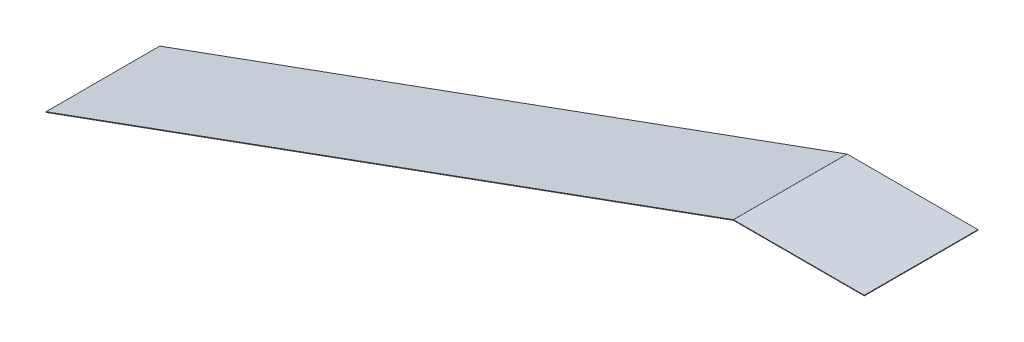
ISO-10303-21;
HEADER;
FILE_DESCRIPTION(('STEP AP214'),'2;1');
FILE_NAME('part.step','',(''),(''),'','','');
FILE_SCHEMA(('AUTOMOTIVE_DESIGN { 1 0 10303 214 1 1 1 1 }'));
ENDSEC;
DATA;
#1=APPLICATION_CONTEXT('core data for automotive mechanical design processes');
#2=APPLICATION_PROTOCOL_DEFINITION('international standard','automotive_design',2000,#1);
#3=PRODUCT_CONTEXT('',#1,'mechanical');
#4=PRODUCT('Part','Part','',(#3));
#5=PRODUCT_RELATED_PRODUCT_CATEGORY('part','',(#4));
#6=PRODUCT_DEFINITION_FORMATION('','',#4);
#7=PRODUCT_DEFINITION_CONTEXT('part definition',#1,'design');
#8=PRODUCT_DEFINITION('design','',#6,#7);
#9=PRODUCT_DEFINITION_SHAPE('','',#8);
#10=(LENGTH_UNIT() NAMED_UNIT(*) SI_UNIT(.MILLI.,.METRE.));
#11=(NAMED_UNIT(*) PLANE_ANGLE_UNIT() SI_UNIT($,.RADIAN.));
#12=(NAMED_UNIT(*) SI_UNIT($,.STERADIAN.) SOLID_ANGLE_UNIT());
#13=UNCERTAINTY_MEASURE_WITH_UNIT(LENGTH_MEASURE(1.E-05),#10,'distance_accuracy_value','');
#14=(GEOMETRIC_REPRESENTATION_CONTEXT(3) GLOBAL_UNCERTAINTY_ASSIGNED_CONTEXT((#13)) GLOBAL_UNIT_ASSIGNED_CONTEXT((#10,
#11,#12)) REPRESENTATION_CONTEXT('',''));
#15=CARTESIAN_POINT('',(0.,0.,0.));
#16=DIRECTION('',(0.,0.,1.));
#17=DIRECTION('',(1.,0.,0.));
#18=AXIS2_PLACEMENT_3D('',#15,#16,#17);
#19=CARTESIAN_POINT('',(1208.72437139741,439.939692620786,200.));
#20=DIRECTION('',(0.,0.,1.));
#21=DIRECTION('',(1.,0.,0.));
#22=AXIS2_PLACEMENT_3D('',#19,#20,#21);
#23=PLANE('',#22);
#24=DIRECTION('',(-0.342020143325728,0.939692620785887,0.));
#25=VECTOR('',#24,1.);
#26=CARTESIAN_POINT('',(1208.72437139741,439.939692620786,200.));
#27=LINE('',#26,#25);
#28=CARTESIAN_POINT('',(1208.72437139741,439.939692620786,200.));
#29=VERTEX_POINT('',#28);
#30=CARTESIAN_POINT('',(1208.38235125409,440.879385241572,200.));
#31=VERTEX_POINT('',#30);
#32=EDGE_CURVE('E11',#29,#31,#27,.T.);
#33=ORIENTED_EDGE('',*,*,#32,.F.);
#34=CARTESIAN_POINT('',(1209.06639154074,439.,200.));
#35=DIRECTION('',(0.,0.,-1.));
#36=DIRECTION('',(-1.,0.,0.));
#37=AXIS2_PLACEMENT_3D('',#34,#35,#36);
#38=CIRCLE('',#37,1.);
#39=CARTESIAN_POINT('',(1209.06639154074,440.,200.));
#40=VERTEX_POINT('',#39);
#41=EDGE_CURVE('E136',#40,#29,#38,.F.);
#42=ORIENTED_EDGE('',*,*,#41,.F.);
#43=DIRECTION('',(0.,-1.,0.));
#44=VECTOR('',#43,1.);
#45=CARTESIAN_POINT('',(1209.06639154074,441.,200.));
#46=LINE('',#45,#44);
#47=CARTESIAN_POINT('',(1209.06639154074,441.,200.));
#48=VERTEX_POINT('',#47);
#49=EDGE_CURVE('E47',#48,#40,#46,.T.);
#50=ORIENTED_EDGE('',*,*,#49,.F.);
#51=CARTESIAN_POINT('',(1209.06639154074,439.,200.));
#52=DIRECTION('',(0.,0.,1.));
#53=DIRECTION('',(1.,0.,0.));
#54=AXIS2_PLACEMENT_3D('',#51,#52,#53);
#55=CIRCLE('',#54,2.);
#56=EDGE_CURVE('E129',#48,#31,#55,.T.);
#57=ORIENTED_EDGE('',*,*,#56,.T.);
#58=EDGE_LOOP('',(#33,#42,#50,#57));
#59=FACE_BOUND('',#58,.T.);
#60=ADVANCED_FACE('F39',(#59),#23,.T.);
#61=CARTESIAN_POINT('',(1209.06639154074,441.,200.));
#62=DIRECTION('',(0.,0.,1.));
#63=DIRECTION('',(1.,0.,0.));
#64=AXIS2_PLACEMENT_3D('',#61,#62,#63);
#65=PLANE('',#64);
#66=DIRECTION('',(-0.939692620785908,-0.342020143325669,0.));
#67=VECTOR('',#66,1.);
#68=CARTESIAN_POINT('',(1208.89006456003,440.,200.));
#69=LINE('',#68,#67);
#70=CARTESIAN_POINT('',(0.,0.,200.));
#71=VERTEX_POINT('',#70);
#72=EDGE_CURVE('E185',#29,#71,#69,.T.);
#73=ORIENTED_EDGE('',*,*,#72,.F.);
#74=ORIENTED_EDGE('',*,*,#32,.T.);
#75=DIRECTION('',(-0.939692620785908,-0.34202014332567,0.));
#76=VECTOR('',#75,1.);
#77=CARTESIAN_POINT('',(1208.54804441671,440.939692620786,200.));
#78=LINE('',#77,#76);
#79=CARTESIAN_POINT('',(-0.342020143325961,0.939692620785859,200.));
#80=VERTEX_POINT('',#79);
#81=EDGE_CURVE('E95',#31,#80,#78,.T.);
#82=ORIENTED_EDGE('',*,*,#81,.T.);
#83=DIRECTION('',(-0.342020143325942,0.939692620785809,0.));
#84=VECTOR('',#83,1.);
#85=CARTESIAN_POINT('',(0.,0.,200.));
#86=LINE('',#85,#84);
#87=EDGE_CURVE('E342',#71,#80,#86,.T.);
#88=ORIENTED_EDGE('',*,*,#87,.F.);
#89=EDGE_LOOP('',(#73,#74,#82,#88));
#90=FACE_BOUND('',#89,.T.);
#91=ADVANCED_FACE('F193',(#90),#65,.T.);
#92=CARTESIAN_POINT('',(1209.06639154074,440.,0.));
#93=DIRECTION('',(0.,0.,-1.));
#94=DIRECTION('',(-1.,0.,0.));
#95=AXIS2_PLACEMENT_3D('',#92,#93,#94);
#96=PLANE('',#95);
#97=DIRECTION('',(0.,1.,0.));
#98=VECTOR('',#97,1.);
#99=CARTESIAN_POINT('',(1209.06639154074,440.,0.));
#100=LINE('',#99,#98);
#101=CARTESIAN_POINT('',(1209.06639154074,440.,0.));
#102=VERTEX_POINT('',#101);
#103=CARTESIAN_POINT('',(1209.06639154074,441.,0.));
#104=VERTEX_POINT('',#103);
#105=EDGE_CURVE('E82',#102,#104,#100,.T.);
#106=ORIENTED_EDGE('',*,*,#105,.F.);
#107=CARTESIAN_POINT('',(1209.06639154074,439.,0.));
#108=DIRECTION('',(0.,0.,-1.));
#109=DIRECTION('',(-1.,0.,0.));
#110=AXIS2_PLACEMENT_3D('',#107,#108,#109);
#111=CIRCLE('',#110,1.);
#112=CARTESIAN_POINT('',(1208.72437139741,439.939692620786,0.));
#113=VERTEX_POINT('',#112);
#114=EDGE_CURVE('E151',#102,#113,#111,.F.);
#115=ORIENTED_EDGE('',*,*,#114,.T.);
#116=DIRECTION('',(0.342020143325728,-0.939692620785887,0.));
#117=VECTOR('',#116,1.);
#118=CARTESIAN_POINT('',(1208.38235125409,440.879385241572,0.));
#119=LINE('',#118,#117);
#120=CARTESIAN_POINT('',(1208.38235125409,440.879385241572,0.));
#121=VERTEX_POINT('',#120);
#122=EDGE_CURVE('E89',#121,#113,#119,.T.);
#123=ORIENTED_EDGE('',*,*,#122,.F.);
#124=CARTESIAN_POINT('',(1209.06639154074,439.,0.));
#125=DIRECTION('',(0.,0.,1.));
#126=DIRECTION('',(1.,0.,0.));
#127=AXIS2_PLACEMENT_3D('',#124,#125,#126);
#128=CIRCLE('',#127,2.);
#129=EDGE_CURVE('E158',#104,#121,#128,.T.);
#130=ORIENTED_EDGE('',*,*,#129,.F.);
#131=EDGE_LOOP('',(#106,#115,#123,#130));
#132=FACE_BOUND('',#131,.T.);
#133=ADVANCED_FACE('F191',(#132),#96,.T.);
#134=CARTESIAN_POINT('',(1208.38235125409,440.879385241572,0.));
#135=DIRECTION('',(0.,0.,-1.));
#136=DIRECTION('',(-1.,0.,0.));
#137=AXIS2_PLACEMENT_3D('',#134,#135,#136);
#138=PLANE('',#137);
#139=DIRECTION('',(-1.,0.,0.));
#140=VECTOR('',#139,1.);
#141=CARTESIAN_POINT('',(1439.004105869,440.,0.));
#142=LINE('',#141,#140);
#143=CARTESIAN_POINT('',(1439.004105869,440.,0.));
#144=VERTEX_POINT('',#143);
#145=EDGE_CURVE('E153',#144,#102,#142,.T.);
#146=ORIENTED_EDGE('',*,*,#145,.T.);
#147=ORIENTED_EDGE('',*,*,#105,.T.);
#148=DIRECTION('',(-1.,0.,0.));
#149=VECTOR('',#148,1.);
#150=CARTESIAN_POINT('',(1439.004105869,441.,0.));
#151=LINE('',#150,#149);
#152=CARTESIAN_POINT('',(1439.004105869,441.,0.));
#153=VERTEX_POINT('',#152);
#154=EDGE_CURVE('E156',#153,#104,#151,.T.);
#155=ORIENTED_EDGE('',*,*,#154,.F.);
#156=DIRECTION('',(0.,-1.,0.));
#157=VECTOR('',#156,1.);
#158=CARTESIAN_POINT('',(1439.004105869,441.,0.));
#159=LINE('',#158,#157);
#160=EDGE_CURVE('E117',#153,#144,#159,.T.);
#161=ORIENTED_EDGE('',*,*,#160,.T.);
#162=EDGE_LOOP('',(#146,#147,#155,#161));
#163=FACE_BOUND('',#162,.T.);
#164=ADVANCED_FACE('F187',(#163),#138,.T.);
#165=CARTESIAN_POINT('',(1208.54804441671,440.939692620786,200.));
#166=DIRECTION('',(0.342020143325669,-0.939692620785908,0.));
#167=DIRECTION('',(0.939692620785908,0.342020143325669,0.));
#168=AXIS2_PLACEMENT_3D('',#165,#166,#167);
#169=PLANE('',#168);
#170=DIRECTION('',(-0.939692620785908,-0.34202014332567,0.));
#171=VECTOR('',#170,1.);
#172=CARTESIAN_POINT('',(1208.54804441671,440.939692620786,0.));
#173=LINE('',#172,#171);
#174=CARTESIAN_POINT('',(-0.342020143325961,0.939692620785859,0.));
#175=VERTEX_POINT('',#174);
#176=EDGE_CURVE('E142',#121,#175,#173,.T.);
#177=ORIENTED_EDGE('',*,*,#176,.T.);
#178=DIRECTION('',(0.,0.,-1.));
#179=VECTOR('',#178,1.);
#180=CARTESIAN_POINT('',(-0.342020143325961,0.939692620785859,200.));
#181=LINE('',#180,#179);
#182=EDGE_CURVE('E172',#80,#175,#181,.T.);
#183=ORIENTED_EDGE('',*,*,#182,.F.);
#184=ORIENTED_EDGE('',*,*,#81,.F.);
#185=DIRECTION('',(0.,0.,-1.));
#186=VECTOR('',#185,1.);
#187=CARTESIAN_POINT('',(1208.38235125409,440.879385241572,200.));
#188=LINE('',#187,#186);
#189=EDGE_CURVE('E141',#31,#121,#188,.T.);
#190=ORIENTED_EDGE('',*,*,#189,.T.);
#191=EDGE_LOOP('',(#177,#183,#184,#190));
#192=FACE_BOUND('',#191,.T.);
#193=ADVANCED_FACE('F199',(#192),#169,.F.);
#194=CARTESIAN_POINT('',(0.,0.,200.));
#195=DIRECTION('',(-0.939692620785809,-0.342020143325942,0.));
#196=DIRECTION('',(0.342020143325942,-0.939692620785809,0.));
#197=AXIS2_PLACEMENT_3D('',#194,#195,#196);
#198=PLANE('',#197);
#199=DIRECTION('',(-0.342020143325942,0.939692620785809,0.));
#200=VECTOR('',#199,1.);
#201=CARTESIAN_POINT('',(0.,0.,0.));
#202=LINE('',#201,#200);
#203=CARTESIAN_POINT('',(0.,0.,0.));
#204=VERTEX_POINT('',#203);
#205=EDGE_CURVE('E145',#204,#175,#202,.T.);
#206=ORIENTED_EDGE('',*,*,#205,.F.);
#207=DIRECTION('',(0.,0.,-1.));
#208=VECTOR('',#207,1.);
#209=CARTESIAN_POINT('',(0.,0.,200.));
#210=LINE('',#209,#208);
#211=EDGE_CURVE('E170',#71,#204,#210,.T.);
#212=ORIENTED_EDGE('',*,*,#211,.F.);
#213=ORIENTED_EDGE('',*,*,#87,.T.);
#214=ORIENTED_EDGE('',*,*,#182,.T.);
#215=EDGE_LOOP('',(#206,#212,#213,#214));
#216=FACE_BOUND('',#215,.T.);
#217=ADVANCED_FACE('F230',(#216),#198,.T.);
#218=CARTESIAN_POINT('',(1208.89006456003,440.,200.));
#219=DIRECTION('',(0.342020143325669,-0.939692620785908,0.));
#220=DIRECTION('',(0.939692620785908,0.34202014332567,0.));
#221=AXIS2_PLACEMENT_3D('',#218,#219,#220);
#222=PLANE('',#221);
#223=DIRECTION('',(-0.939692620785908,-0.342020143325669,0.));
#224=VECTOR('',#223,1.);
#225=CARTESIAN_POINT('',(1208.89006456003,440.,0.));
#226=LINE('',#225,#224);
#227=EDGE_CURVE('E148',#113,#204,#226,.T.);
#228=ORIENTED_EDGE('',*,*,#227,.F.);
#229=DIRECTION('',(0.,0.,-1.));
#230=VECTOR('',#229,1.);
#231=CARTESIAN_POINT('',(1208.72437139741,439.939692620786,200.));
#232=LINE('',#231,#230);
#233=EDGE_CURVE('E167',#29,#113,#232,.T.);
#234=ORIENTED_EDGE('',*,*,#233,.F.);
#235=ORIENTED_EDGE('',*,*,#72,.T.);
#236=ORIENTED_EDGE('',*,*,#211,.T.);
#237=EDGE_LOOP('',(#228,#234,#235,#236));
#238=FACE_BOUND('',#237,.T.);
#239=ADVANCED_FACE('F241',(#238),#222,.T.);
#240=CARTESIAN_POINT('',(1209.06639154074,439.,200.));
#241=DIRECTION('',(0.,0.,-1.));
#242=DIRECTION('',(-1.,0.,0.));
#243=AXIS2_PLACEMENT_3D('',#240,#241,#242);
#244=CYLINDRICAL_SURFACE('',#243,1.);
#245=ORIENTED_EDGE('',*,*,#114,.F.);
#246=DIRECTION('',(0.,0.,-1.));
#247=VECTOR('',#246,1.);
#248=CARTESIAN_POINT('',(1209.06639154074,440.,200.));
#249=LINE('',#248,#247);
#250=EDGE_CURVE('E164',#40,#102,#249,.T.);
#251=ORIENTED_EDGE('',*,*,#250,.F.);
#252=ORIENTED_EDGE('',*,*,#41,.T.);
#253=ORIENTED_EDGE('',*,*,#233,.T.);
#254=EDGE_LOOP('',(#245,#251,#252,#253));
#255=FACE_BOUND('',#254,.T.);
#256=ADVANCED_FACE('F181',(#255),#244,.F.);
#257=CARTESIAN_POINT('',(1439.004105869,440.,200.));
#258=DIRECTION('',(0.,-1.,0.));
#259=DIRECTION('',(1.,0.,0.));
#260=AXIS2_PLACEMENT_3D('',#257,#258,#259);
#261=PLANE('',#260);
#262=ORIENTED_EDGE('',*,*,#145,.F.);
#263=DIRECTION('',(0.,0.,-1.));
#264=VECTOR('',#263,1.);
#265=CARTESIAN_POINT('',(1439.004105869,440.,200.));
#266=LINE('',#265,#264);
#267=CARTESIAN_POINT('',(1439.004105869,440.,200.));
#268=VERTEX_POINT('',#267);
#269=EDGE_CURVE('E119',#268,#144,#266,.T.);
#270=ORIENTED_EDGE('',*,*,#269,.F.);
#271=DIRECTION('',(-1.,0.,0.));
#272=VECTOR('',#271,1.);
#273=CARTESIAN_POINT('',(1439.004105869,440.,200.));
#274=LINE('',#273,#272);
#275=EDGE_CURVE('E134',#268,#40,#274,.T.);
#276=ORIENTED_EDGE('',*,*,#275,.T.);
#277=ORIENTED_EDGE('',*,*,#250,.T.);
#278=EDGE_LOOP('',(#262,#270,#276,#277));
#279=FACE_BOUND('',#278,.T.);
#280=ADVANCED_FACE('F186',(#279),#261,.T.);
#281=CARTESIAN_POINT('',(1439.004105869,441.,200.));
#282=DIRECTION('',(1.,0.,0.));
#283=DIRECTION('',(0.,0.,-1.));
#284=AXIS2_PLACEMENT_3D('',#281,#282,#283);
#285=PLANE('',#284);
#286=ORIENTED_EDGE('',*,*,#160,.F.);
#287=DIRECTION('',(0.,0.,-1.));
#288=VECTOR('',#287,1.);
#289=CARTESIAN_POINT('',(1439.004105869,441.,200.));
#290=LINE('',#289,#288);
#291=CARTESIAN_POINT('',(1439.004105869,441.,200.));
#292=VERTEX_POINT('',#291);
#293=EDGE_CURVE('E111',#292,#153,#290,.T.);
#294=ORIENTED_EDGE('',*,*,#293,.F.);
#295=DIRECTION('',(0.,-1.,0.));
#296=VECTOR('',#295,1.);
#297=CARTESIAN_POINT('',(1439.004105869,441.,200.));
#298=LINE('',#297,#296);
#299=EDGE_CURVE('E115',#292,#268,#298,.T.);
#300=ORIENTED_EDGE('',*,*,#299,.T.);
#301=ORIENTED_EDGE('',*,*,#269,.T.);
#302=EDGE_LOOP('',(#286,#294,#300,#301));
#303=FACE_BOUND('',#302,.T.);
#304=ADVANCED_FACE('F113',(#303),#285,.T.);
#305=CARTESIAN_POINT('',(1439.004105869,441.,200.));
#306=DIRECTION('',(0.,-1.,0.));
#307=DIRECTION('',(1.,0.,0.));
#308=AXIS2_PLACEMENT_3D('',#305,#306,#307);
#309=PLANE('',#308);
#310=ORIENTED_EDGE('',*,*,#154,.T.);
#311=DIRECTION('',(0.,0.,-1.));
#312=VECTOR('',#311,1.);
#313=CARTESIAN_POINT('',(1209.06639154074,441.,200.));
#314=LINE('',#313,#312);
#315=EDGE_CURVE('E120',#48,#104,#314,.T.);
#316=ORIENTED_EDGE('',*,*,#315,.F.);
#317=DIRECTION('',(-1.,0.,0.));
#318=VECTOR('',#317,1.);
#319=CARTESIAN_POINT('',(1439.004105869,441.,200.));
#320=LINE('',#319,#318);
#321=EDGE_CURVE('E124',#292,#48,#320,.T.);
#322=ORIENTED_EDGE('',*,*,#321,.F.);
#323=ORIENTED_EDGE('',*,*,#293,.T.);
#324=EDGE_LOOP('',(#310,#316,#322,#323));
#325=FACE_BOUND('',#324,.T.);
#326=ADVANCED_FACE('F125',(#325),#309,.F.);
#327=CARTESIAN_POINT('',(1209.06639154074,439.,200.));
#328=DIRECTION('',(0.,0.,-1.));
#329=DIRECTION('',(-1.,0.,0.));
#330=AXIS2_PLACEMENT_3D('',#327,#328,#329);
#331=CYLINDRICAL_SURFACE('',#330,2.);
#332=ORIENTED_EDGE('',*,*,#129,.T.);
#333=ORIENTED_EDGE('',*,*,#189,.F.);
#334=ORIENTED_EDGE('',*,*,#56,.F.);
#335=ORIENTED_EDGE('',*,*,#315,.T.);
#336=EDGE_LOOP('',(#332,#333,#334,#335));
#337=FACE_BOUND('',#336,.T.);
#338=ADVANCED_FACE('F189',(#337),#331,.T.);
#339=CARTESIAN_POINT('',(1209.06639154074,439.,200.));
#340=DIRECTION('',(0.,0.,-1.));
#341=DIRECTION('',(-1.,0.,0.));
#342=AXIS2_PLACEMENT_3D('',#339,#340,#341);
#343=PLANE('',#342);
#344=ORIENTED_EDGE('',*,*,#321,.T.);
#345=ORIENTED_EDGE('',*,*,#49,.T.);
#346=ORIENTED_EDGE('',*,*,#275,.F.);
#347=ORIENTED_EDGE('',*,*,#299,.F.);
#348=EDGE_LOOP('',(#344,#345,#346,#347));
#349=FACE_BOUND('',#348,.T.);
#350=ADVANCED_FACE('F132',(#349),#343,.F.);
#351=CARTESIAN_POINT('',(1209.06639154074,439.,0.));
#352=DIRECTION('',(0.,0.,-1.));
#353=DIRECTION('',(-1.,0.,0.));
#354=AXIS2_PLACEMENT_3D('',#351,#352,#353);
#355=PLANE('',#354);
#356=ORIENTED_EDGE('',*,*,#176,.F.);
#357=ORIENTED_EDGE('',*,*,#122,.T.);
#358=ORIENTED_EDGE('',*,*,#227,.T.);
#359=ORIENTED_EDGE('',*,*,#205,.T.);
#360=EDGE_LOOP('',(#356,#357,#358,#359));
#361=FACE_BOUND('',#360,.T.);
#362=ADVANCED_FACE('F307',(#361),#355,.T.);
#363=CLOSED_SHELL('',(#60,#91,#133,#164,#193,#217,#239,#256,#280,#304,#326,#338,#350,#362));
#364=MANIFOLD_SOLID_BREP('B2',#363);
#365=ADVANCED_BREP_SHAPE_REPRESENTATION('',(#18,#364),#14);
#366=SHAPE_DEFINITION_REPRESENTATION(#9,#365);
ENDSEC;
END-ISO-10303-21;
